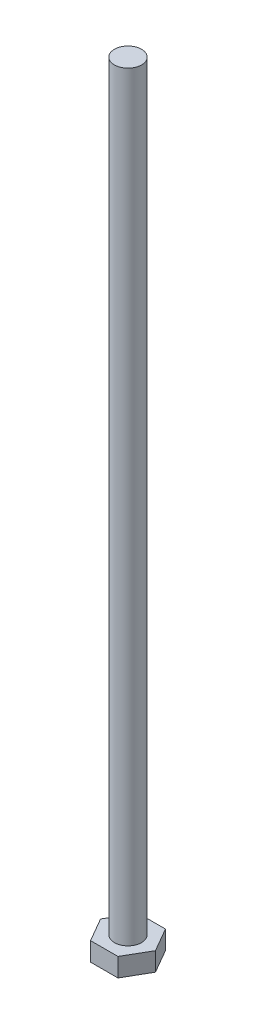
ISO-10303-21;
HEADER;
FILE_DESCRIPTION(('STEP AP214'),'2;1');
FILE_NAME('part.step','',(''),(''),'','','');
FILE_SCHEMA(('AUTOMOTIVE_DESIGN { 1 0 10303 214 1 1 1 1 }'));
ENDSEC;
DATA;
#1=APPLICATION_CONTEXT('core data for automotive mechanical design processes');
#2=APPLICATION_PROTOCOL_DEFINITION('international standard','automotive_design',2000,#1);
#3=PRODUCT_CONTEXT('',#1,'mechanical');
#4=PRODUCT('Part','Part','',(#3));
#5=PRODUCT_RELATED_PRODUCT_CATEGORY('part','',(#4));
#6=PRODUCT_DEFINITION_FORMATION('','',#4);
#7=PRODUCT_DEFINITION_CONTEXT('part definition',#1,'design');
#8=PRODUCT_DEFINITION('design','',#6,#7);
#9=PRODUCT_DEFINITION_SHAPE('','',#8);
#10=(LENGTH_UNIT() NAMED_UNIT(*) SI_UNIT(.MILLI.,.METRE.));
#11=(NAMED_UNIT(*) PLANE_ANGLE_UNIT() SI_UNIT($,.RADIAN.));
#12=(NAMED_UNIT(*) SI_UNIT($,.STERADIAN.) SOLID_ANGLE_UNIT());
#13=UNCERTAINTY_MEASURE_WITH_UNIT(LENGTH_MEASURE(1.E-05),#10,'distance_accuracy_value','');
#14=(GEOMETRIC_REPRESENTATION_CONTEXT(3) GLOBAL_UNCERTAINTY_ASSIGNED_CONTEXT((#13)) GLOBAL_UNIT_ASSIGNED_CONTEXT((#10,
#11,#12)) REPRESENTATION_CONTEXT('',''));
#15=CARTESIAN_POINT('',(0.,0.,0.));
#16=DIRECTION('',(0.,0.,1.));
#17=DIRECTION('',(1.,0.,0.));
#18=AXIS2_PLACEMENT_3D('',#15,#16,#17);
#19=CARTESIAN_POINT('',(0.,4.365625,0.));
#20=DIRECTION('',(0.,1.,0.));
#21=DIRECTION('',(0.,0.,1.));
#22=AXIS2_PLACEMENT_3D('',#19,#20,#21);
#23=PLANE('',#22);
#24=DIRECTION('',(0.499999999999995,0.,-0.866025403784441));
#25=VECTOR('',#24,1.);
#26=CARTESIAN_POINT('',(3.20790243318491,4.365625,5.55624999999994));
#27=LINE('',#26,#25);
#28=CARTESIAN_POINT('',(3.20790243318491,4.365625,5.55624999999994));
#29=VERTEX_POINT('',#28);
#30=CARTESIAN_POINT('',(6.4158048663697,4.365625,0.));
#31=VERTEX_POINT('',#30);
#32=EDGE_CURVE('E129',#29,#31,#27,.T.);
#33=ORIENTED_EDGE('',*,*,#32,.T.);
#34=DIRECTION('',(-0.500000000000001,0.,-0.866025403784438));
#35=VECTOR('',#34,1.);
#36=CARTESIAN_POINT('',(6.4158048663697,4.365625,0.));
#37=LINE('',#36,#35);
#38=CARTESIAN_POINT('',(3.20790243318483,4.365625,-5.55624999999999));
#39=VERTEX_POINT('',#38);
#40=EDGE_CURVE('E87',#31,#39,#37,.T.);
#41=ORIENTED_EDGE('',*,*,#40,.T.);
#42=DIRECTION('',(-1.,0.,0.));
#43=VECTOR('',#42,1.);
#44=CARTESIAN_POINT('',(3.20790243318483,4.365625,-5.55624999999999));
#45=LINE('',#44,#43);
#46=CARTESIAN_POINT('',(-3.20790243318487,4.365625,-5.55624999999997));
#47=VERTEX_POINT('',#46);
#48=EDGE_CURVE('E100',#39,#47,#45,.T.);
#49=ORIENTED_EDGE('',*,*,#48,.T.);
#50=DIRECTION('',(-0.499999999999995,0.,0.866025403784441));
#51=VECTOR('',#50,1.);
#52=CARTESIAN_POINT('',(-3.20790243318487,4.365625,-5.55624999999997));
#53=LINE('',#52,#51);
#54=CARTESIAN_POINT('',(-6.4158048663697,4.365625,0.));
#55=VERTEX_POINT('',#54);
#56=EDGE_CURVE('E94',#47,#55,#53,.T.);
#57=ORIENTED_EDGE('',*,*,#56,.T.);
#58=DIRECTION('',(0.500000000000007,0.,0.866025403784434));
#59=VECTOR('',#58,1.);
#60=CARTESIAN_POINT('',(-6.4158048663697,4.365625,0.));
#61=LINE('',#60,#59);
#62=CARTESIAN_POINT('',(-3.2079024331848,4.365625,5.55625000000001));
#63=VERTEX_POINT('',#62);
#64=EDGE_CURVE('E98',#55,#63,#61,.T.);
#65=ORIENTED_EDGE('',*,*,#64,.T.);
#66=DIRECTION('',(1.,0.,0.));
#67=VECTOR('',#66,1.);
#68=CARTESIAN_POINT('',(-3.2079024331848,4.365625,5.55625000000001));
#69=LINE('',#68,#67);
#70=EDGE_CURVE('E50',#63,#29,#69,.T.);
#71=ORIENTED_EDGE('',*,*,#70,.T.);
#72=EDGE_LOOP('',(#33,#41,#49,#57,#65,#71));
#73=FACE_BOUND('',#72,.T.);
#74=CARTESIAN_POINT('',(0.,4.365625,0.));
#75=DIRECTION('',(0.,1.,0.));
#76=DIRECTION('',(0.,0.,1.));
#77=AXIS2_PLACEMENT_3D('',#74,#75,#76);
#78=CIRCLE('',#77,3.175);
#79=CARTESIAN_POINT('',(0.,4.365625,3.175));
#80=VERTEX_POINT('',#79);
#81=EDGE_CURVE('E169',#80,#80,#78,.T.);
#82=ORIENTED_EDGE('',*,*,#81,.F.);
#83=EDGE_LOOP('',(#82));
#84=FACE_BOUND('',#83,.T.);
#85=ADVANCED_FACE('F33',(#73,#84),#23,.T.);
#86=CARTESIAN_POINT('',(3.20790243318491,4.365625,5.55624999999994));
#87=DIRECTION('',(-0.866025403784442,0.,-0.499999999999995));
#88=DIRECTION('',(-0.499999999999995,0.,0.866025403784442));
#89=AXIS2_PLACEMENT_3D('',#86,#87,#88);
#90=PLANE('',#89);
#91=DIRECTION('',(0.499999999999995,0.,-0.866025403784441));
#92=VECTOR('',#91,1.);
#93=CARTESIAN_POINT('',(3.20790243318491,0.,5.55624999999994));
#94=LINE('',#93,#92);
#95=CARTESIAN_POINT('',(3.20790243318491,0.,5.55624999999994));
#96=VERTEX_POINT('',#95);
#97=CARTESIAN_POINT('',(6.4158048663697,0.,0.));
#98=VERTEX_POINT('',#97);
#99=EDGE_CURVE('E118',#96,#98,#94,.T.);
#100=ORIENTED_EDGE('',*,*,#99,.T.);
#101=DIRECTION('',(0.,-1.,0.));
#102=VECTOR('',#101,1.);
#103=CARTESIAN_POINT('',(6.4158048663697,4.365625,0.));
#104=LINE('',#103,#102);
#105=EDGE_CURVE('E11',#31,#98,#104,.T.);
#106=ORIENTED_EDGE('',*,*,#105,.F.);
#107=ORIENTED_EDGE('',*,*,#32,.F.);
#108=DIRECTION('',(0.,-1.,0.));
#109=VECTOR('',#108,1.);
#110=CARTESIAN_POINT('',(3.20790243318491,4.365625,5.55624999999994));
#111=LINE('',#110,#109);
#112=EDGE_CURVE('E114',#29,#96,#111,.T.);
#113=ORIENTED_EDGE('',*,*,#112,.T.);
#114=EDGE_LOOP('',(#100,#106,#107,#113));
#115=FACE_BOUND('',#114,.T.);
#116=ADVANCED_FACE('F35',(#115),#90,.F.);
#117=CARTESIAN_POINT('',(6.4158048663697,4.365625,0.));
#118=DIRECTION('',(-0.866025403784438,0.,0.500000000000001));
#119=DIRECTION('',(0.500000000000001,0.,0.866025403784438));
#120=AXIS2_PLACEMENT_3D('',#117,#118,#119);
#121=PLANE('',#120);
#122=DIRECTION('',(-0.500000000000001,0.,-0.866025403784438));
#123=VECTOR('',#122,1.);
#124=CARTESIAN_POINT('',(6.4158048663697,0.,0.));
#125=LINE('',#124,#123);
#126=CARTESIAN_POINT('',(3.20790243318483,0.,-5.55624999999999));
#127=VERTEX_POINT('',#126);
#128=EDGE_CURVE('E121',#98,#127,#125,.T.);
#129=ORIENTED_EDGE('',*,*,#128,.T.);
#130=DIRECTION('',(0.,-1.,0.));
#131=VECTOR('',#130,1.);
#132=CARTESIAN_POINT('',(3.20790243318483,4.365625,-5.55624999999999));
#133=LINE('',#132,#131);
#134=EDGE_CURVE('E42',#39,#127,#133,.T.);
#135=ORIENTED_EDGE('',*,*,#134,.F.);
#136=ORIENTED_EDGE('',*,*,#40,.F.);
#137=ORIENTED_EDGE('',*,*,#105,.T.);
#138=EDGE_LOOP('',(#129,#135,#136,#137));
#139=FACE_BOUND('',#138,.T.);
#140=ADVANCED_FACE('F157',(#139),#121,.F.);
#141=CARTESIAN_POINT('',(3.20790243318483,4.365625,-5.55624999999999));
#142=DIRECTION('',(0.,0.,1.));
#143=DIRECTION('',(1.,0.,0.));
#144=AXIS2_PLACEMENT_3D('',#141,#142,#143);
#145=PLANE('',#144);
#146=DIRECTION('',(-1.,0.,0.));
#147=VECTOR('',#146,1.);
#148=CARTESIAN_POINT('',(3.20790243318483,0.,-5.55624999999999));
#149=LINE('',#148,#147);
#150=CARTESIAN_POINT('',(-3.20790243318487,0.,-5.55624999999997));
#151=VERTEX_POINT('',#150);
#152=EDGE_CURVE('E124',#127,#151,#149,.T.);
#153=ORIENTED_EDGE('',*,*,#152,.T.);
#154=DIRECTION('',(0.,-1.,0.));
#155=VECTOR('',#154,1.);
#156=CARTESIAN_POINT('',(-3.20790243318487,4.365625,-5.55624999999997));
#157=LINE('',#156,#155);
#158=EDGE_CURVE('E109',#47,#151,#157,.T.);
#159=ORIENTED_EDGE('',*,*,#158,.F.);
#160=ORIENTED_EDGE('',*,*,#48,.F.);
#161=ORIENTED_EDGE('',*,*,#134,.T.);
#162=EDGE_LOOP('',(#153,#159,#160,#161));
#163=FACE_BOUND('',#162,.T.);
#164=ADVANCED_FACE('F135',(#163),#145,.F.);
#165=CARTESIAN_POINT('',(-3.20790243318487,4.365625,-5.55624999999997));
#166=DIRECTION('',(0.866025403784442,0.,0.499999999999995));
#167=DIRECTION('',(0.499999999999995,0.,-0.866025403784442));
#168=AXIS2_PLACEMENT_3D('',#165,#166,#167);
#169=PLANE('',#168);
#170=DIRECTION('',(-0.499999999999995,0.,0.866025403784441));
#171=VECTOR('',#170,1.);
#172=CARTESIAN_POINT('',(-3.20790243318487,0.,-5.55624999999997));
#173=LINE('',#172,#171);
#174=CARTESIAN_POINT('',(-6.4158048663697,0.,0.));
#175=VERTEX_POINT('',#174);
#176=EDGE_CURVE('E108',#151,#175,#173,.T.);
#177=ORIENTED_EDGE('',*,*,#176,.T.);
#178=DIRECTION('',(0.,-1.,0.));
#179=VECTOR('',#178,1.);
#180=CARTESIAN_POINT('',(-6.4158048663697,4.365625,0.));
#181=LINE('',#180,#179);
#182=EDGE_CURVE('E105',#55,#175,#181,.T.);
#183=ORIENTED_EDGE('',*,*,#182,.F.);
#184=ORIENTED_EDGE('',*,*,#56,.F.);
#185=ORIENTED_EDGE('',*,*,#158,.T.);
#186=EDGE_LOOP('',(#177,#183,#184,#185));
#187=FACE_BOUND('',#186,.T.);
#188=ADVANCED_FACE('F106',(#187),#169,.F.);
#189=CARTESIAN_POINT('',(-6.4158048663697,4.365625,0.));
#190=DIRECTION('',(0.866025403784435,0.,-0.500000000000007));
#191=DIRECTION('',(-0.500000000000007,0.,-0.866025403784435));
#192=AXIS2_PLACEMENT_3D('',#189,#190,#191);
#193=PLANE('',#192);
#194=DIRECTION('',(0.500000000000007,0.,0.866025403784434));
#195=VECTOR('',#194,1.);
#196=CARTESIAN_POINT('',(-6.4158048663697,0.,0.));
#197=LINE('',#196,#195);
#198=CARTESIAN_POINT('',(-3.2079024331848,0.,5.55625000000001));
#199=VERTEX_POINT('',#198);
#200=EDGE_CURVE('E73',#175,#199,#197,.T.);
#201=ORIENTED_EDGE('',*,*,#200,.T.);
#202=DIRECTION('',(0.,-1.,0.));
#203=VECTOR('',#202,1.);
#204=CARTESIAN_POINT('',(-3.2079024331848,4.365625,5.55625000000001));
#205=LINE('',#204,#203);
#206=EDGE_CURVE('E110',#63,#199,#205,.T.);
#207=ORIENTED_EDGE('',*,*,#206,.F.);
#208=ORIENTED_EDGE('',*,*,#64,.F.);
#209=ORIENTED_EDGE('',*,*,#182,.T.);
#210=EDGE_LOOP('',(#201,#207,#208,#209));
#211=FACE_BOUND('',#210,.T.);
#212=ADVANCED_FACE('F112',(#211),#193,.F.);
#213=CARTESIAN_POINT('',(-3.2079024331848,4.365625,5.55625000000001));
#214=DIRECTION('',(0.,0.,-1.));
#215=DIRECTION('',(-1.,0.,0.));
#216=AXIS2_PLACEMENT_3D('',#213,#214,#215);
#217=PLANE('',#216);
#218=DIRECTION('',(1.,0.,0.));
#219=VECTOR('',#218,1.);
#220=CARTESIAN_POINT('',(-3.2079024331848,0.,5.55625000000001));
#221=LINE('',#220,#219);
#222=EDGE_CURVE('E79',#199,#96,#221,.T.);
#223=ORIENTED_EDGE('',*,*,#222,.T.);
#224=ORIENTED_EDGE('',*,*,#112,.F.);
#225=ORIENTED_EDGE('',*,*,#70,.F.);
#226=ORIENTED_EDGE('',*,*,#206,.T.);
#227=EDGE_LOOP('',(#223,#224,#225,#226));
#228=FACE_BOUND('',#227,.T.);
#229=ADVANCED_FACE('F142',(#228),#217,.F.);
#230=CARTESIAN_POINT('',(0.,0.,0.));
#231=DIRECTION('',(0.,1.,0.));
#232=DIRECTION('',(0.,0.,1.));
#233=AXIS2_PLACEMENT_3D('',#230,#231,#232);
#234=PLANE('',#233);
#235=ORIENTED_EDGE('',*,*,#99,.F.);
#236=ORIENTED_EDGE('',*,*,#222,.F.);
#237=ORIENTED_EDGE('',*,*,#200,.F.);
#238=ORIENTED_EDGE('',*,*,#176,.F.);
#239=ORIENTED_EDGE('',*,*,#152,.F.);
#240=ORIENTED_EDGE('',*,*,#128,.F.);
#241=EDGE_LOOP('',(#235,#236,#237,#238,#239,#240));
#242=FACE_BOUND('',#241,.T.);
#243=ADVANCED_FACE('F138',(#242),#234,.F.);
#244=CARTESIAN_POINT('',(0.,182.165625,0.));
#245=DIRECTION('',(0.,-1.,0.));
#246=DIRECTION('',(0.,0.,-1.));
#247=AXIS2_PLACEMENT_3D('',#244,#245,#246);
#248=CYLINDRICAL_SURFACE('',#247,3.175);
#249=CARTESIAN_POINT('',(0.,182.165625,0.));
#250=DIRECTION('',(0.,1.,0.));
#251=DIRECTION('',(0.,0.,1.));
#252=AXIS2_PLACEMENT_3D('',#249,#250,#251);
#253=CIRCLE('',#252,3.175);
#254=CARTESIAN_POINT('',(0.,182.165625,3.175));
#255=VERTEX_POINT('',#254);
#256=EDGE_CURVE('E122',#255,#255,#253,.T.);
#257=ORIENTED_EDGE('',*,*,#256,.F.);
#258=EDGE_LOOP('',(#257));
#259=FACE_BOUND('',#258,.T.);
#260=ORIENTED_EDGE('',*,*,#81,.T.);
#261=EDGE_LOOP('',(#260));
#262=FACE_BOUND('',#261,.T.);
#263=ADVANCED_FACE('F149',(#259,#262),#248,.T.);
#264=CARTESIAN_POINT('',(0.,182.165625,0.));
#265=DIRECTION('',(0.,1.,0.));
#266=DIRECTION('',(0.,0.,1.));
#267=AXIS2_PLACEMENT_3D('',#264,#265,#266);
#268=PLANE('',#267);
#269=ORIENTED_EDGE('',*,*,#256,.T.);
#270=EDGE_LOOP('',(#269));
#271=FACE_BOUND('',#270,.T.);
#272=ADVANCED_FACE('F161',(#271),#268,.T.);
#273=CLOSED_SHELL('',(#85,#116,#140,#164,#188,#212,#229,#243,#263,#272));
#274=MANIFOLD_SOLID_BREP('B2',#273);
#275=ADVANCED_BREP_SHAPE_REPRESENTATION('',(#18,#274),#14);
#276=SHAPE_DEFINITION_REPRESENTATION(#9,#275);
ENDSEC;
END-ISO-10303-21;
